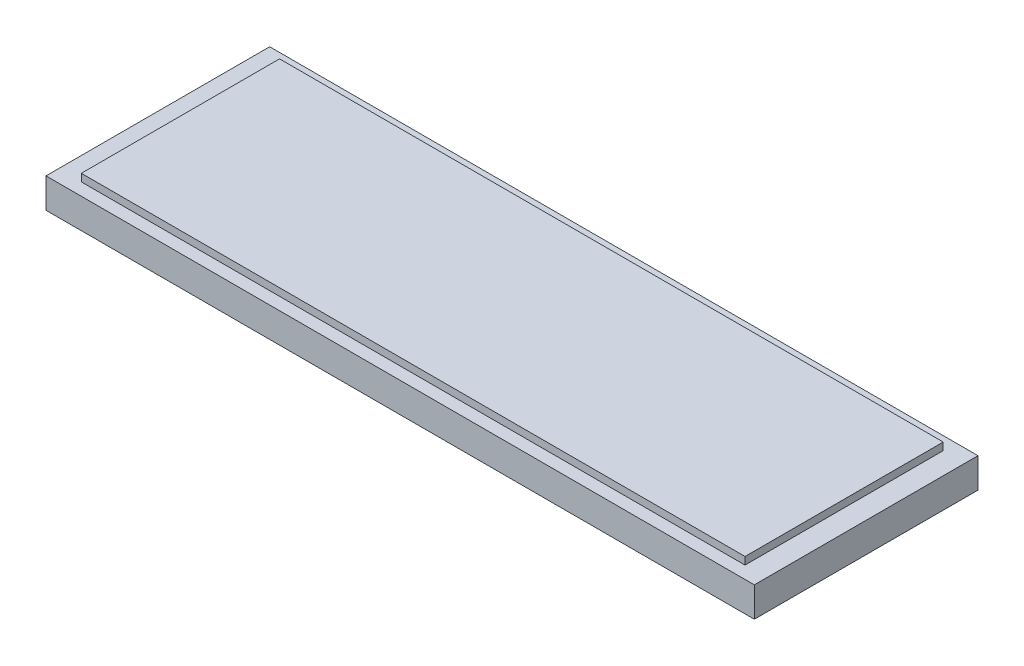
ISO-10303-21;
HEADER;
FILE_DESCRIPTION(('STEP AP214'),'2;1');
FILE_NAME('part.step','',(''),(''),'','','');
FILE_SCHEMA(('AUTOMOTIVE_DESIGN { 1 0 10303 214 1 1 1 1 }'));
ENDSEC;
DATA;
#1=APPLICATION_CONTEXT('core data for automotive mechanical design processes');
#2=APPLICATION_PROTOCOL_DEFINITION('international standard','automotive_design',2000,#1);
#3=PRODUCT_CONTEXT('',#1,'mechanical');
#4=PRODUCT('Part','Part','',(#3));
#5=PRODUCT_RELATED_PRODUCT_CATEGORY('part','',(#4));
#6=PRODUCT_DEFINITION_FORMATION('','',#4);
#7=PRODUCT_DEFINITION_CONTEXT('part definition',#1,'design');
#8=PRODUCT_DEFINITION('design','',#6,#7);
#9=PRODUCT_DEFINITION_SHAPE('','',#8);
#10=(LENGTH_UNIT() NAMED_UNIT(*) SI_UNIT(.MILLI.,.METRE.));
#11=(NAMED_UNIT(*) PLANE_ANGLE_UNIT() SI_UNIT($,.RADIAN.));
#12=(NAMED_UNIT(*) SI_UNIT($,.STERADIAN.) SOLID_ANGLE_UNIT());
#13=UNCERTAINTY_MEASURE_WITH_UNIT(LENGTH_MEASURE(1.E-05),#10,'distance_accuracy_value','');
#14=(GEOMETRIC_REPRESENTATION_CONTEXT(3) GLOBAL_UNCERTAINTY_ASSIGNED_CONTEXT((#13)) GLOBAL_UNIT_ASSIGNED_CONTEXT((#10,
#11,#12)) REPRESENTATION_CONTEXT('',''));
#15=CARTESIAN_POINT('',(0.,0.,0.));
#16=DIRECTION('',(0.,0.,1.));
#17=DIRECTION('',(1.,0.,0.));
#18=AXIS2_PLACEMENT_3D('',#15,#16,#17);
#19=CARTESIAN_POINT('',(-103.050847457627,8.,-43.0200308166409));
#20=DIRECTION('',(1.,0.,0.));
#21=DIRECTION('',(0.,0.,-1.));
#22=AXIS2_PLACEMENT_3D('',#19,#20,#21);
#23=PLANE('',#22);
#24=DIRECTION('',(0.,0.,1.));
#25=VECTOR('',#24,1.);
#26=CARTESIAN_POINT('',(-103.050847457627,0.,-43.0200308166409));
#27=LINE('',#26,#25);
#28=CARTESIAN_POINT('',(-103.050847457627,0.,-43.0200308166409));
#29=VERTEX_POINT('',#28);
#30=CARTESIAN_POINT('',(-103.050847457627,0.,16.9799691833591));
#31=VERTEX_POINT('',#30);
#32=EDGE_CURVE('E135',#29,#31,#27,.T.);
#33=ORIENTED_EDGE('',*,*,#32,.T.);
#34=DIRECTION('',(0.,-1.,0.));
#35=VECTOR('',#34,1.);
#36=CARTESIAN_POINT('',(-103.050847457627,8.,16.9799691833591));
#37=LINE('',#36,#35);
#38=CARTESIAN_POINT('',(-103.050847457627,8.,16.9799691833591));
#39=VERTEX_POINT('',#38);
#40=EDGE_CURVE('E11',#39,#31,#37,.T.);
#41=ORIENTED_EDGE('',*,*,#40,.F.);
#42=DIRECTION('',(0.,0.,1.));
#43=VECTOR('',#42,1.);
#44=CARTESIAN_POINT('',(-103.050847457627,8.,-43.0200308166409));
#45=LINE('',#44,#43);
#46=CARTESIAN_POINT('',(-103.050847457627,8.,-43.0200308166409));
#47=VERTEX_POINT('',#46);
#48=EDGE_CURVE('E146',#47,#39,#45,.T.);
#49=ORIENTED_EDGE('',*,*,#48,.F.);
#50=DIRECTION('',(0.,-1.,0.));
#51=VECTOR('',#50,1.);
#52=CARTESIAN_POINT('',(-103.050847457627,8.,-43.0200308166409));
#53=LINE('',#52,#51);
#54=EDGE_CURVE('E159',#47,#29,#53,.T.);
#55=ORIENTED_EDGE('',*,*,#54,.T.);
#56=EDGE_LOOP('',(#33,#41,#49,#55));
#57=FACE_BOUND('',#56,.T.);
#58=ADVANCED_FACE('F47',(#57),#23,.F.);
#59=CARTESIAN_POINT('',(-103.050847457627,8.,16.9799691833591));
#60=DIRECTION('',(0.,0.,-1.));
#61=DIRECTION('',(-1.,0.,0.));
#62=AXIS2_PLACEMENT_3D('',#59,#60,#61);
#63=PLANE('',#62);
#64=DIRECTION('',(1.,0.,0.));
#65=VECTOR('',#64,1.);
#66=CARTESIAN_POINT('',(-103.050847457627,0.,16.9799691833591));
#67=LINE('',#66,#65);
#68=CARTESIAN_POINT('',(86.9491525423729,0.,16.9799691833591));
#69=VERTEX_POINT('',#68);
#70=EDGE_CURVE('E140',#31,#69,#67,.T.);
#71=ORIENTED_EDGE('',*,*,#70,.T.);
#72=DIRECTION('',(0.,-1.,0.));
#73=VECTOR('',#72,1.);
#74=CARTESIAN_POINT('',(86.9491525423729,8.,16.9799691833591));
#75=LINE('',#74,#73);
#76=CARTESIAN_POINT('',(86.9491525423729,8.,16.9799691833591));
#77=VERTEX_POINT('',#76);
#78=EDGE_CURVE('E55',#77,#69,#75,.T.);
#79=ORIENTED_EDGE('',*,*,#78,.F.);
#80=DIRECTION('',(1.,0.,0.));
#81=VECTOR('',#80,1.);
#82=CARTESIAN_POINT('',(-103.050847457627,8.,16.9799691833591));
#83=LINE('',#82,#81);
#84=EDGE_CURVE('E150',#39,#77,#83,.T.);
#85=ORIENTED_EDGE('',*,*,#84,.F.);
#86=ORIENTED_EDGE('',*,*,#40,.T.);
#87=EDGE_LOOP('',(#71,#79,#85,#86));
#88=FACE_BOUND('',#87,.T.);
#89=ADVANCED_FACE('F196',(#88),#63,.F.);
#90=CARTESIAN_POINT('',(86.9491525423729,8.,-43.0200308166409));
#91=DIRECTION('',(-1.,0.,0.));
#92=DIRECTION('',(0.,0.,1.));
#93=AXIS2_PLACEMENT_3D('',#90,#91,#92);
#94=PLANE('',#93);
#95=DIRECTION('',(0.,0.,-1.));
#96=VECTOR('',#95,1.);
#97=CARTESIAN_POINT('',(86.9491525423729,0.,-43.0200308166409));
#98=LINE('',#97,#96);
#99=CARTESIAN_POINT('',(86.9491525423729,0.,-43.0200308166409));
#100=VERTEX_POINT('',#99);
#101=EDGE_CURVE('E163',#69,#100,#98,.T.);
#102=ORIENTED_EDGE('',*,*,#101,.T.);
#103=DIRECTION('',(0.,-1.,0.));
#104=VECTOR('',#103,1.);
#105=CARTESIAN_POINT('',(86.9491525423729,8.,-43.0200308166409));
#106=LINE('',#105,#104);
#107=CARTESIAN_POINT('',(86.9491525423729,8.,-43.0200308166409));
#108=VERTEX_POINT('',#107);
#109=EDGE_CURVE('E171',#108,#100,#106,.T.);
#110=ORIENTED_EDGE('',*,*,#109,.F.);
#111=DIRECTION('',(0.,0.,-1.));
#112=VECTOR('',#111,1.);
#113=CARTESIAN_POINT('',(86.9491525423729,8.,-43.0200308166409));
#114=LINE('',#113,#112);
#115=EDGE_CURVE('E154',#77,#108,#114,.T.);
#116=ORIENTED_EDGE('',*,*,#115,.F.);
#117=ORIENTED_EDGE('',*,*,#78,.T.);
#118=EDGE_LOOP('',(#102,#110,#116,#117));
#119=FACE_BOUND('',#118,.T.);
#120=ADVANCED_FACE('F180',(#119),#94,.F.);
#121=CARTESIAN_POINT('',(-103.050847457627,8.,-43.0200308166409));
#122=DIRECTION('',(0.,0.,1.));
#123=DIRECTION('',(1.,0.,0.));
#124=AXIS2_PLACEMENT_3D('',#121,#122,#123);
#125=PLANE('',#124);
#126=DIRECTION('',(-1.,0.,0.));
#127=VECTOR('',#126,1.);
#128=CARTESIAN_POINT('',(-103.050847457627,0.,-43.0200308166409));
#129=LINE('',#128,#127);
#130=EDGE_CURVE('E151',#100,#29,#129,.T.);
#131=ORIENTED_EDGE('',*,*,#130,.T.);
#132=ORIENTED_EDGE('',*,*,#54,.F.);
#133=DIRECTION('',(-1.,0.,0.));
#134=VECTOR('',#133,1.);
#135=CARTESIAN_POINT('',(-103.050847457627,8.,-43.0200308166409));
#136=LINE('',#135,#134);
#137=EDGE_CURVE('E157',#108,#47,#136,.T.);
#138=ORIENTED_EDGE('',*,*,#137,.F.);
#139=ORIENTED_EDGE('',*,*,#109,.T.);
#140=EDGE_LOOP('',(#131,#132,#138,#139));
#141=FACE_BOUND('',#140,.T.);
#142=ADVANCED_FACE('F189',(#141),#125,.F.);
#143=CARTESIAN_POINT('',(0.,8.,0.));
#144=DIRECTION('',(0.,1.,0.));
#145=DIRECTION('',(0.,0.,1.));
#146=AXIS2_PLACEMENT_3D('',#143,#144,#145);
#147=PLANE('',#146);
#148=DIRECTION('',(0.,0.,1.));
#149=VECTOR('',#148,1.);
#150=CARTESIAN_POINT('',(-96.9140897162792,8.,-39.5283878293914));
#151=LINE('',#150,#149);
#152=CARTESIAN_POINT('',(-96.9140897162792,8.,-39.5283878293914));
#153=VERTEX_POINT('',#152);
#154=CARTESIAN_POINT('',(-96.9140897162792,8.,13.6389418609547));
#155=VERTEX_POINT('',#154);
#156=EDGE_CURVE('E62',#153,#155,#151,.T.);
#157=ORIENTED_EDGE('',*,*,#156,.F.);
#158=DIRECTION('',(-1.,0.,0.));
#159=VECTOR('',#158,1.);
#160=CARTESIAN_POINT('',(-96.9140897162792,8.,-39.5283878293914));
#161=LINE('',#160,#159);
#162=CARTESIAN_POINT('',(81.1136261307154,8.,-39.5283878293914));
#163=VERTEX_POINT('',#162);
#164=EDGE_CURVE('E66',#163,#153,#161,.T.);
#165=ORIENTED_EDGE('',*,*,#164,.F.);
#166=DIRECTION('',(0.,0.,-1.));
#167=VECTOR('',#166,1.);
#168=CARTESIAN_POINT('',(81.1136261307154,8.,-39.5283878293914));
#169=LINE('',#168,#167);
#170=CARTESIAN_POINT('',(81.1136261307154,8.,13.6389418609547));
#171=VERTEX_POINT('',#170);
#172=EDGE_CURVE('E329',#171,#163,#169,.T.);
#173=ORIENTED_EDGE('',*,*,#172,.F.);
#174=DIRECTION('',(1.,0.,0.));
#175=VECTOR('',#174,1.);
#176=CARTESIAN_POINT('',(-96.9140897162792,8.,13.6389418609547));
#177=LINE('',#176,#175);
#178=EDGE_CURVE('E339',#155,#171,#177,.T.);
#179=ORIENTED_EDGE('',*,*,#178,.F.);
#180=EDGE_LOOP('',(#157,#165,#173,#179));
#181=FACE_BOUND('',#180,.T.);
#182=ORIENTED_EDGE('',*,*,#48,.T.);
#183=ORIENTED_EDGE('',*,*,#84,.T.);
#184=ORIENTED_EDGE('',*,*,#115,.T.);
#185=ORIENTED_EDGE('',*,*,#137,.T.);
#186=EDGE_LOOP('',(#182,#183,#184,#185));
#187=FACE_BOUND('',#186,.T.);
#188=ADVANCED_FACE('F195',(#181,#187),#147,.T.);
#189=CARTESIAN_POINT('',(0.,0.,0.));
#190=DIRECTION('',(0.,1.,0.));
#191=DIRECTION('',(0.,0.,1.));
#192=AXIS2_PLACEMENT_3D('',#189,#190,#191);
#193=PLANE('',#192);
#194=ORIENTED_EDGE('',*,*,#32,.F.);
#195=ORIENTED_EDGE('',*,*,#130,.F.);
#196=ORIENTED_EDGE('',*,*,#101,.F.);
#197=ORIENTED_EDGE('',*,*,#70,.F.);
#198=EDGE_LOOP('',(#194,#195,#196,#197));
#199=FACE_BOUND('',#198,.T.);
#200=ADVANCED_FACE('F186',(#199),#193,.F.);
#201=CARTESIAN_POINT('',(-96.9140897162792,10.,-39.5283878293914));
#202=DIRECTION('',(1.,0.,0.));
#203=DIRECTION('',(0.,0.,-1.));
#204=AXIS2_PLACEMENT_3D('',#201,#202,#203);
#205=PLANE('',#204);
#206=ORIENTED_EDGE('',*,*,#156,.T.);
#207=DIRECTION('',(0.,-1.,0.));
#208=VECTOR('',#207,1.);
#209=CARTESIAN_POINT('',(-96.9140897162792,10.,13.6389418609547));
#210=LINE('',#209,#208);
#211=CARTESIAN_POINT('',(-96.9140897162792,10.,13.6389418609547));
#212=VERTEX_POINT('',#211);
#213=EDGE_CURVE('E115',#212,#155,#210,.T.);
#214=ORIENTED_EDGE('',*,*,#213,.F.);
#215=DIRECTION('',(0.,0.,1.));
#216=VECTOR('',#215,1.);
#217=CARTESIAN_POINT('',(-96.9140897162792,10.,-39.5283878293914));
#218=LINE('',#217,#216);
#219=CARTESIAN_POINT('',(-96.9140897162792,10.,-39.5283878293914));
#220=VERTEX_POINT('',#219);
#221=EDGE_CURVE('E122',#220,#212,#218,.T.);
#222=ORIENTED_EDGE('',*,*,#221,.F.);
#223=DIRECTION('',(0.,-1.,0.));
#224=VECTOR('',#223,1.);
#225=CARTESIAN_POINT('',(-96.9140897162792,10.,-39.5283878293914));
#226=LINE('',#225,#224);
#227=EDGE_CURVE('E326',#220,#153,#226,.T.);
#228=ORIENTED_EDGE('',*,*,#227,.T.);
#229=EDGE_LOOP('',(#206,#214,#222,#228));
#230=FACE_BOUND('',#229,.T.);
#231=ADVANCED_FACE('F133',(#230),#205,.F.);
#232=CARTESIAN_POINT('',(-96.9140897162792,10.,13.6389418609547));
#233=DIRECTION('',(0.,0.,-1.));
#234=DIRECTION('',(-1.,0.,0.));
#235=AXIS2_PLACEMENT_3D('',#232,#233,#234);
#236=PLANE('',#235);
#237=ORIENTED_EDGE('',*,*,#178,.T.);
#238=DIRECTION('',(0.,-1.,0.));
#239=VECTOR('',#238,1.);
#240=CARTESIAN_POINT('',(81.1136261307154,10.,13.6389418609547));
#241=LINE('',#240,#239);
#242=CARTESIAN_POINT('',(81.1136261307154,10.,13.6389418609547));
#243=VERTEX_POINT('',#242);
#244=EDGE_CURVE('E117',#243,#171,#241,.T.);
#245=ORIENTED_EDGE('',*,*,#244,.F.);
#246=DIRECTION('',(1.,0.,0.));
#247=VECTOR('',#246,1.);
#248=CARTESIAN_POINT('',(-96.9140897162792,10.,13.6389418609547));
#249=LINE('',#248,#247);
#250=EDGE_CURVE('E110',#212,#243,#249,.T.);
#251=ORIENTED_EDGE('',*,*,#250,.F.);
#252=ORIENTED_EDGE('',*,*,#213,.T.);
#253=EDGE_LOOP('',(#237,#245,#251,#252));
#254=FACE_BOUND('',#253,.T.);
#255=ADVANCED_FACE('F113',(#254),#236,.F.);
#256=CARTESIAN_POINT('',(81.1136261307154,10.,-39.5283878293914));
#257=DIRECTION('',(-1.,0.,0.));
#258=DIRECTION('',(0.,0.,1.));
#259=AXIS2_PLACEMENT_3D('',#256,#257,#258);
#260=PLANE('',#259);
#261=ORIENTED_EDGE('',*,*,#172,.T.);
#262=DIRECTION('',(0.,-1.,0.));
#263=VECTOR('',#262,1.);
#264=CARTESIAN_POINT('',(81.1136261307154,10.,-39.5283878293914));
#265=LINE('',#264,#263);
#266=CARTESIAN_POINT('',(81.1136261307154,10.,-39.5283878293914));
#267=VERTEX_POINT('',#266);
#268=EDGE_CURVE('E142',#267,#163,#265,.T.);
#269=ORIENTED_EDGE('',*,*,#268,.F.);
#270=DIRECTION('',(0.,0.,-1.));
#271=VECTOR('',#270,1.);
#272=CARTESIAN_POINT('',(81.1136261307154,10.,-39.5283878293914));
#273=LINE('',#272,#271);
#274=EDGE_CURVE('E121',#243,#267,#273,.T.);
#275=ORIENTED_EDGE('',*,*,#274,.F.);
#276=ORIENTED_EDGE('',*,*,#244,.T.);
#277=EDGE_LOOP('',(#261,#269,#275,#276));
#278=FACE_BOUND('',#277,.T.);
#279=ADVANCED_FACE('F214',(#278),#260,.F.);
#280=CARTESIAN_POINT('',(-96.9140897162792,10.,-39.5283878293914));
#281=DIRECTION('',(0.,0.,1.));
#282=DIRECTION('',(1.,0.,0.));
#283=AXIS2_PLACEMENT_3D('',#280,#281,#282);
#284=PLANE('',#283);
#285=ORIENTED_EDGE('',*,*,#164,.T.);
#286=ORIENTED_EDGE('',*,*,#227,.F.);
#287=DIRECTION('',(-1.,0.,0.));
#288=VECTOR('',#287,1.);
#289=CARTESIAN_POINT('',(-96.9140897162792,10.,-39.5283878293914));
#290=LINE('',#289,#288);
#291=EDGE_CURVE('E127',#267,#220,#290,.T.);
#292=ORIENTED_EDGE('',*,*,#291,.F.);
#293=ORIENTED_EDGE('',*,*,#268,.T.);
#294=EDGE_LOOP('',(#285,#286,#292,#293));
#295=FACE_BOUND('',#294,.T.);
#296=ADVANCED_FACE('F217',(#295),#284,.F.);
#297=CARTESIAN_POINT('',(0.,10.,0.));
#298=DIRECTION('',(0.,1.,0.));
#299=DIRECTION('',(0.,0.,1.));
#300=AXIS2_PLACEMENT_3D('',#297,#298,#299);
#301=PLANE('',#300);
#302=ORIENTED_EDGE('',*,*,#221,.T.);
#303=ORIENTED_EDGE('',*,*,#250,.T.);
#304=ORIENTED_EDGE('',*,*,#274,.T.);
#305=ORIENTED_EDGE('',*,*,#291,.T.);
#306=EDGE_LOOP('',(#302,#303,#304,#305));
#307=FACE_BOUND('',#306,.T.);
#308=ADVANCED_FACE('F125',(#307),#301,.T.);
#309=CLOSED_SHELL('',(#58,#89,#120,#142,#188,#200,#231,#255,#279,#296,#308));
#310=MANIFOLD_SOLID_BREP('B2',#309);
#311=ADVANCED_BREP_SHAPE_REPRESENTATION('',(#18,#310),#14);
#312=SHAPE_DEFINITION_REPRESENTATION(#9,#311);
ENDSEC;
END-ISO-10303-21;
